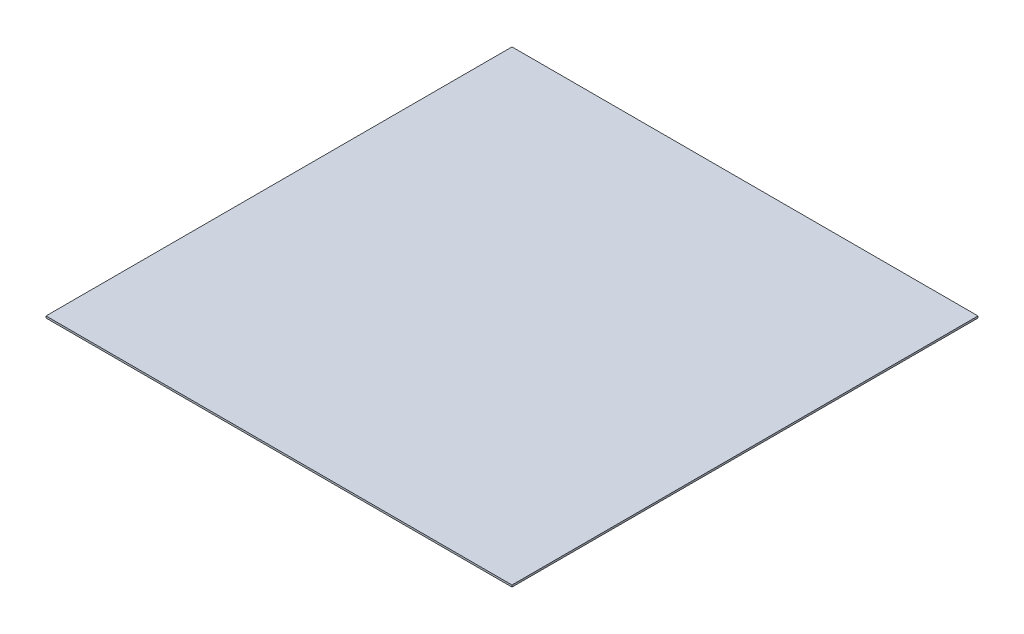
ISO-10303-21;
HEADER;
FILE_DESCRIPTION(('STEP AP214'),'2;1');
FILE_NAME('part.step','',(''),(''),'','','');
FILE_SCHEMA(('AUTOMOTIVE_DESIGN { 1 0 10303 214 1 1 1 1 }'));
ENDSEC;
DATA;
#1=APPLICATION_CONTEXT('core data for automotive mechanical design processes');
#2=APPLICATION_PROTOCOL_DEFINITION('international standard','automotive_design',2000,#1);
#3=PRODUCT_CONTEXT('',#1,'mechanical');
#4=PRODUCT('Part','Part','',(#3));
#5=PRODUCT_RELATED_PRODUCT_CATEGORY('part','',(#4));
#6=PRODUCT_DEFINITION_FORMATION('','',#4);
#7=PRODUCT_DEFINITION_CONTEXT('part definition',#1,'design');
#8=PRODUCT_DEFINITION('design','',#6,#7);
#9=PRODUCT_DEFINITION_SHAPE('','',#8);
#10=(LENGTH_UNIT() NAMED_UNIT(*) SI_UNIT(.MILLI.,.METRE.));
#11=(NAMED_UNIT(*) PLANE_ANGLE_UNIT() SI_UNIT($,.RADIAN.));
#12=(NAMED_UNIT(*) SI_UNIT($,.STERADIAN.) SOLID_ANGLE_UNIT());
#13=UNCERTAINTY_MEASURE_WITH_UNIT(LENGTH_MEASURE(1.E-05),#10,'distance_accuracy_value','');
#14=(GEOMETRIC_REPRESENTATION_CONTEXT(3) GLOBAL_UNCERTAINTY_ASSIGNED_CONTEXT((#13)) GLOBAL_UNIT_ASSIGNED_CONTEXT((#10,
#11,#12)) REPRESENTATION_CONTEXT('',''));
#15=CARTESIAN_POINT('',(0.,0.,0.));
#16=DIRECTION('',(0.,0.,1.));
#17=DIRECTION('',(1.,0.,0.));
#18=AXIS2_PLACEMENT_3D('',#15,#16,#17);
#19=CARTESIAN_POINT('',(103.,9.99999999999999,-10.));
#20=DIRECTION('',(0.,0.,1.));
#21=DIRECTION('',(1.,0.,0.));
#22=AXIS2_PLACEMENT_3D('',#19,#20,#21);
#23=PLANE('',#22);
#24=CARTESIAN_POINT('',(0.,55.,-10.));
#25=DIRECTION('',(0.,0.,1.));
#26=DIRECTION('',(1.,0.,0.));
#27=AXIS2_PLACEMENT_3D('',#24,#25,#26);
#28=CIRCLE('',#27,15.);
#29=CARTESIAN_POINT('',(-14.1421356237309,60.,-10.));
#30=VERTEX_POINT('',#29);
#31=CARTESIAN_POINT('',(-13.467179647447,48.3943151495556,-10.));
#32=VERTEX_POINT('',#31);
#33=EDGE_CURVE('E11',#30,#32,#28,.T.);
#34=ORIENTED_EDGE('',*,*,#33,.F.);
#35=DIRECTION('',(-1.,0.,0.));
#36=VECTOR('',#35,1.);
#37=CARTESIAN_POINT('',(103.,60.,-10.));
#38=LINE('',#37,#36);
#39=CARTESIAN_POINT('',(-20.,60.,-10.));
#40=VERTEX_POINT('',#39);
#41=EDGE_CURVE('E285',#30,#40,#38,.T.);
#42=ORIENTED_EDGE('',*,*,#41,.T.);
#43=DIRECTION('',(-0.330350424728106,-0.943858356366018,0.));
#44=VECTOR('',#43,1.);
#45=CARTESIAN_POINT('',(-20.,60.,-10.));
#46=LINE('',#45,#44);
#47=CARTESIAN_POINT('',(-37.5,9.99999999999999,-10.));
#48=VERTEX_POINT('',#47);
#49=EDGE_CURVE('E319',#40,#48,#46,.T.);
#50=ORIENTED_EDGE('',*,*,#49,.T.);
#51=DIRECTION('',(-1.,0.,0.));
#52=VECTOR('',#51,1.);
#53=CARTESIAN_POINT('',(103.,9.99999999999999,-10.));
#54=LINE('',#53,#52);
#55=CARTESIAN_POINT('',(-26.9051899497914,9.99999999999999,-10.));
#56=VERTEX_POINT('',#55);
#57=EDGE_CURVE('E288',#56,#48,#54,.T.);
#58=ORIENTED_EDGE('',*,*,#57,.F.);
#59=DIRECTION('',(0.330350424728106,0.943858356366017,0.));
#60=VECTOR('',#59,1.);
#61=CARTESIAN_POINT('',(-12.9051899497914,50.,-10.));
#62=LINE('',#61,#60);
#63=EDGE_CURVE('E308',#56,#32,#62,.T.);
#64=ORIENTED_EDGE('',*,*,#63,.T.);
#65=EDGE_LOOP('',(#34,#42,#50,#58,#64));
#66=FACE_BOUND('',#65,.T.);
#67=ADVANCED_FACE('F38',(#66),#23,.T.);
#68=CARTESIAN_POINT('',(103.,9.99999999999999,10.));
#69=DIRECTION('',(0.,0.,-1.));
#70=DIRECTION('',(-1.,0.,0.));
#71=AXIS2_PLACEMENT_3D('',#68,#69,#70);
#72=PLANE('',#71);
#73=CARTESIAN_POINT('',(0.,55.,10.));
#74=DIRECTION('',(0.,0.,-1.));
#75=DIRECTION('',(-1.,0.,0.));
#76=AXIS2_PLACEMENT_3D('',#73,#74,#75);
#77=CIRCLE('',#76,15.);
#78=CARTESIAN_POINT('',(14.1421356237309,60.,10.));
#79=VERTEX_POINT('',#78);
#80=CARTESIAN_POINT('',(13.467179647447,48.3943151495556,10.));
#81=VERTEX_POINT('',#80);
#82=EDGE_CURVE('E226',#79,#81,#77,.T.);
#83=ORIENTED_EDGE('',*,*,#82,.F.);
#84=DIRECTION('',(-1.,0.,0.));
#85=VECTOR('',#84,1.);
#86=CARTESIAN_POINT('',(103.,60.,10.));
#87=LINE('',#86,#85);
#88=CARTESIAN_POINT('',(20.,60.,9.99999999999999));
#89=VERTEX_POINT('',#88);
#90=EDGE_CURVE('E204',#89,#79,#87,.T.);
#91=ORIENTED_EDGE('',*,*,#90,.F.);
#92=DIRECTION('',(0.330350424728106,-0.943858356366018,0.));
#93=VECTOR('',#92,1.);
#94=CARTESIAN_POINT('',(20.,60.,9.99999999999999));
#95=LINE('',#94,#93);
#96=CARTESIAN_POINT('',(37.5,9.99999999999999,10.));
#97=VERTEX_POINT('',#96);
#98=EDGE_CURVE('E304',#89,#97,#95,.T.);
#99=ORIENTED_EDGE('',*,*,#98,.T.);
#100=DIRECTION('',(-1.,0.,0.));
#101=VECTOR('',#100,1.);
#102=CARTESIAN_POINT('',(103.,9.99999999999999,10.));
#103=LINE('',#102,#101);
#104=CARTESIAN_POINT('',(26.9051899497914,9.99999999999999,10.));
#105=VERTEX_POINT('',#104);
#106=EDGE_CURVE('E217',#97,#105,#103,.T.);
#107=ORIENTED_EDGE('',*,*,#106,.T.);
#108=DIRECTION('',(-0.330350424728106,0.943858356366018,0.));
#109=VECTOR('',#108,1.);
#110=CARTESIAN_POINT('',(12.9051899497914,50.,9.99999999999999));
#111=LINE('',#110,#109);
#112=EDGE_CURVE('E301',#105,#81,#111,.T.);
#113=ORIENTED_EDGE('',*,*,#112,.T.);
#114=EDGE_LOOP('',(#83,#91,#99,#107,#113));
#115=FACE_BOUND('',#114,.T.);
#116=ADVANCED_FACE('F470',(#115),#72,.T.);
#117=CARTESIAN_POINT('',(0.,60.,0.));
#118=DIRECTION('',(0.,1.,0.));
#119=DIRECTION('',(0.,0.,1.));
#120=AXIS2_PLACEMENT_3D('',#117,#118,#119);
#121=PLANE('',#120);
#122=DIRECTION('',(0.,0.,-1.));
#123=VECTOR('',#122,1.);
#124=CARTESIAN_POINT('',(-20.,60.,0.));
#125=LINE('',#124,#123);
#126=CARTESIAN_POINT('',(-20.,60.,-20.));
#127=VERTEX_POINT('',#126);
#128=EDGE_CURVE('E397',#40,#127,#125,.T.);
#129=ORIENTED_EDGE('',*,*,#128,.F.);
#130=ORIENTED_EDGE('',*,*,#41,.F.);
#131=CARTESIAN_POINT('',(14.1421356237309,60.,-10.));
#132=VERTEX_POINT('',#131);
#133=EDGE_CURVE('E289',#132,#30,#38,.T.);
#134=ORIENTED_EDGE('',*,*,#133,.F.);
#135=CARTESIAN_POINT('',(20.,60.,-10.));
#136=VERTEX_POINT('',#135);
#137=EDGE_CURVE('E286',#136,#132,#38,.T.);
#138=ORIENTED_EDGE('',*,*,#137,.F.);
#139=DIRECTION('',(0.,0.,1.));
#140=VECTOR('',#139,1.);
#141=CARTESIAN_POINT('',(20.,60.,0.));
#142=LINE('',#141,#140);
#143=CARTESIAN_POINT('',(20.,60.,-20.));
#144=VERTEX_POINT('',#143);
#145=EDGE_CURVE('E401',#144,#136,#142,.T.);
#146=ORIENTED_EDGE('',*,*,#145,.F.);
#147=DIRECTION('',(-1.,0.,0.));
#148=VECTOR('',#147,1.);
#149=CARTESIAN_POINT('',(103.,60.,-20.));
#150=LINE('',#149,#148);
#151=EDGE_CURVE('E321',#144,#127,#150,.T.);
#152=ORIENTED_EDGE('',*,*,#151,.T.);
#153=EDGE_LOOP('',(#129,#130,#134,#138,#146,#152));
#154=FACE_BOUND('',#153,.T.);
#155=ADVANCED_FACE('F476',(#154),#121,.T.);
#156=CARTESIAN_POINT('',(20.,60.,20.));
#157=VERTEX_POINT('',#156);
#158=EDGE_CURVE('E400',#89,#157,#142,.T.);
#159=ORIENTED_EDGE('',*,*,#158,.F.);
#160=ORIENTED_EDGE('',*,*,#90,.T.);
#161=CARTESIAN_POINT('',(-14.1421356237309,60.,10.));
#162=VERTEX_POINT('',#161);
#163=EDGE_CURVE('E197',#79,#162,#87,.T.);
#164=ORIENTED_EDGE('',*,*,#163,.T.);
#165=CARTESIAN_POINT('',(-20.,60.,10.));
#166=VERTEX_POINT('',#165);
#167=EDGE_CURVE('E202',#162,#166,#87,.T.);
#168=ORIENTED_EDGE('',*,*,#167,.T.);
#169=CARTESIAN_POINT('',(-20.,60.,20.));
#170=VERTEX_POINT('',#169);
#171=EDGE_CURVE('E398',#170,#166,#125,.T.);
#172=ORIENTED_EDGE('',*,*,#171,.F.);
#173=DIRECTION('',(-1.,0.,0.));
#174=VECTOR('',#173,1.);
#175=CARTESIAN_POINT('',(103.,60.,20.));
#176=LINE('',#175,#174);
#177=EDGE_CURVE('E324',#157,#170,#176,.T.);
#178=ORIENTED_EDGE('',*,*,#177,.F.);
#179=EDGE_LOOP('',(#159,#160,#164,#168,#172,#178));
#180=FACE_BOUND('',#179,.T.);
#181=ADVANCED_FACE('F200',(#180),#121,.T.);
#182=CARTESIAN_POINT('',(-20.,60.,-65.5));
#183=DIRECTION('',(0.943858356366017,-0.330350424728106,0.));
#184=DIRECTION('',(0.330350424728106,0.943858356366018,0.));
#185=AXIS2_PLACEMENT_3D('',#182,#183,#184);
#186=PLANE('',#185);
#187=ORIENTED_EDGE('',*,*,#49,.F.);
#188=ORIENTED_EDGE('',*,*,#128,.T.);
#189=DIRECTION('',(0.313677500463755,0.896221429896442,0.313677500463755));
#190=VECTOR('',#189,1.);
#191=CARTESIAN_POINT('',(-24.4769076305221,47.2088353413655,-24.4769076305221));
#192=LINE('',#191,#190);
#193=CARTESIAN_POINT('',(-37.5,10.,-37.5));
#194=VERTEX_POINT('',#193);
#195=EDGE_CURVE('E333',#194,#127,#192,.T.);
#196=ORIENTED_EDGE('',*,*,#195,.F.);
#197=DIRECTION('',(0.,0.,1.));
#198=VECTOR('',#197,1.);
#199=CARTESIAN_POINT('',(-37.5,10.,37.5));
#200=LINE('',#199,#198);
#201=EDGE_CURVE('E365',#194,#48,#200,.T.);
#202=ORIENTED_EDGE('',*,*,#201,.T.);
#203=EDGE_LOOP('',(#187,#188,#196,#202));
#204=FACE_BOUND('',#203,.T.);
#205=ADVANCED_FACE('F514',(#204),#186,.F.);
#206=DIRECTION('',(0.330350424728106,0.943858356366018,0.));
#207=VECTOR('',#206,1.);
#208=CARTESIAN_POINT('',(-20.,60.,9.99999999999999));
#209=LINE('',#208,#207);
#210=CARTESIAN_POINT('',(-37.5,9.99999999999999,10.));
#211=VERTEX_POINT('',#210);
#212=EDGE_CURVE('E215',#211,#166,#209,.T.);
#213=ORIENTED_EDGE('',*,*,#212,.F.);
#214=CARTESIAN_POINT('',(-37.5,9.99999999999999,37.5));
#215=VERTEX_POINT('',#214);
#216=EDGE_CURVE('E352',#211,#215,#200,.T.);
#217=ORIENTED_EDGE('',*,*,#216,.T.);
#218=DIRECTION('',(-0.313677500463755,-0.896221429896442,0.313677500463755));
#219=VECTOR('',#218,1.);
#220=CARTESIAN_POINT('',(-11.5873493975904,84.0361445783133,11.5873493975904));
#221=LINE('',#220,#219);
#222=EDGE_CURVE('E345',#170,#215,#221,.T.);
#223=ORIENTED_EDGE('',*,*,#222,.F.);
#224=ORIENTED_EDGE('',*,*,#171,.T.);
#225=EDGE_LOOP('',(#213,#217,#223,#224));
#226=FACE_BOUND('',#225,.T.);
#227=ADVANCED_FACE('F512',(#226),#186,.F.);
#228=CARTESIAN_POINT('',(20.,60.,-65.5));
#229=DIRECTION('',(-0.943858356366017,-0.330350424728106,0.));
#230=DIRECTION('',(0.330350424728106,-0.943858356366018,0.));
#231=AXIS2_PLACEMENT_3D('',#228,#229,#230);
#232=PLANE('',#231);
#233=DIRECTION('',(-0.330350424728106,0.943858356366018,0.));
#234=VECTOR('',#233,1.);
#235=CARTESIAN_POINT('',(20.,60.,-10.));
#236=LINE('',#235,#234);
#237=CARTESIAN_POINT('',(37.5,9.99999999999999,-10.));
#238=VERTEX_POINT('',#237);
#239=EDGE_CURVE('E317',#238,#136,#236,.T.);
#240=ORIENTED_EDGE('',*,*,#239,.F.);
#241=DIRECTION('',(0.,0.,-1.));
#242=VECTOR('',#241,1.);
#243=CARTESIAN_POINT('',(37.5,10.,37.5));
#244=LINE('',#243,#242);
#245=CARTESIAN_POINT('',(37.5,10.,-37.5));
#246=VERTEX_POINT('',#245);
#247=EDGE_CURVE('E372',#238,#246,#244,.T.);
#248=ORIENTED_EDGE('',*,*,#247,.T.);
#249=DIRECTION('',(0.313677500463755,-0.896221429896442,-0.313677500463755));
#250=VECTOR('',#249,1.);
#251=CARTESIAN_POINT('',(24.4769076305221,47.2088353413655,-24.4769076305221));
#252=LINE('',#251,#250);
#253=EDGE_CURVE('E330',#144,#246,#252,.T.);
#254=ORIENTED_EDGE('',*,*,#253,.F.);
#255=ORIENTED_EDGE('',*,*,#145,.T.);
#256=EDGE_LOOP('',(#240,#248,#254,#255));
#257=FACE_BOUND('',#256,.T.);
#258=ADVANCED_FACE('F509',(#257),#232,.F.);
#259=ORIENTED_EDGE('',*,*,#98,.F.);
#260=ORIENTED_EDGE('',*,*,#158,.T.);
#261=DIRECTION('',(-0.313677500463755,0.896221429896442,-0.313677500463755));
#262=VECTOR('',#261,1.);
#263=CARTESIAN_POINT('',(11.5873493975904,84.0361445783133,11.5873493975904));
#264=LINE('',#263,#262);
#265=CARTESIAN_POINT('',(37.5,9.99999999999998,37.5));
#266=VERTEX_POINT('',#265);
#267=EDGE_CURVE('E342',#266,#157,#264,.T.);
#268=ORIENTED_EDGE('',*,*,#267,.F.);
#269=EDGE_CURVE('E373',#266,#97,#244,.T.);
#270=ORIENTED_EDGE('',*,*,#269,.T.);
#271=EDGE_LOOP('',(#259,#260,#268,#270));
#272=FACE_BOUND('',#271,.T.);
#273=ADVANCED_FACE('F507',(#272),#232,.F.);
#274=CARTESIAN_POINT('',(12.9051899497914,50.,-65.5));
#275=DIRECTION('',(0.,1.,0.));
#276=DIRECTION('',(0.,0.,1.));
#277=AXIS2_PLACEMENT_3D('',#274,#275,#276);
#278=PLANE('',#277);
#279=DIRECTION('',(1.,0.,0.));
#280=VECTOR('',#279,1.);
#281=CARTESIAN_POINT('',(12.9051899497914,50.,-10.));
#282=LINE('',#281,#280);
#283=CARTESIAN_POINT('',(-12.9051899497914,50.,-10.));
#284=VERTEX_POINT('',#283);
#285=CARTESIAN_POINT('',(12.9051899497914,50.,-10.));
#286=VERTEX_POINT('',#285);
#287=EDGE_CURVE('E310',#284,#286,#282,.T.);
#288=ORIENTED_EDGE('',*,*,#287,.F.);
#289=DIRECTION('',(0.,0.,1.));
#290=VECTOR('',#289,1.);
#291=CARTESIAN_POINT('',(-12.9051899497914,50.,-65.5));
#292=LINE('',#291,#290);
#293=CARTESIAN_POINT('',(-12.9051899497914,50.,-23.5));
#294=VERTEX_POINT('',#293);
#295=EDGE_CURVE('E362',#294,#284,#292,.T.);
#296=ORIENTED_EDGE('',*,*,#295,.F.);
#297=DIRECTION('',(-1.,0.,0.));
#298=VECTOR('',#297,1.);
#299=CARTESIAN_POINT('',(12.9051899497914,50.,-23.5));
#300=LINE('',#299,#298);
#301=CARTESIAN_POINT('',(12.9051899497914,50.,-23.5));
#302=VERTEX_POINT('',#301);
#303=EDGE_CURVE('E326',#302,#294,#300,.T.);
#304=ORIENTED_EDGE('',*,*,#303,.F.);
#305=DIRECTION('',(0.,0.,1.));
#306=VECTOR('',#305,1.);
#307=CARTESIAN_POINT('',(12.9051899497914,50.,-65.5));
#308=LINE('',#307,#306);
#309=EDGE_CURVE('E349',#302,#286,#308,.T.);
#310=ORIENTED_EDGE('',*,*,#309,.T.);
#311=EDGE_LOOP('',(#288,#296,#304,#310));
#312=FACE_BOUND('',#311,.T.);
#313=ADVANCED_FACE('F504',(#312),#278,.F.);
#314=DIRECTION('',(-1.,0.,0.));
#315=VECTOR('',#314,1.);
#316=CARTESIAN_POINT('',(12.9051899497914,50.,9.99999999999999));
#317=LINE('',#316,#315);
#318=CARTESIAN_POINT('',(12.9051899497914,50.,9.99999999999999));
#319=VERTEX_POINT('',#318);
#320=CARTESIAN_POINT('',(-12.9051899497914,50.,9.99999999999999));
#321=VERTEX_POINT('',#320);
#322=EDGE_CURVE('E296',#319,#321,#317,.T.);
#323=ORIENTED_EDGE('',*,*,#322,.F.);
#324=CARTESIAN_POINT('',(12.9051899497914,50.,23.5));
#325=VERTEX_POINT('',#324);
#326=EDGE_CURVE('E353',#319,#325,#308,.T.);
#327=ORIENTED_EDGE('',*,*,#326,.T.);
#328=DIRECTION('',(1.,0.,0.));
#329=VECTOR('',#328,1.);
#330=CARTESIAN_POINT('',(12.9051899497914,50.,23.5));
#331=LINE('',#330,#329);
#332=CARTESIAN_POINT('',(-12.9051899497914,50.,23.5));
#333=VERTEX_POINT('',#332);
#334=EDGE_CURVE('E336',#333,#325,#331,.T.);
#335=ORIENTED_EDGE('',*,*,#334,.F.);
#336=EDGE_CURVE('E348',#321,#333,#292,.T.);
#337=ORIENTED_EDGE('',*,*,#336,.F.);
#338=EDGE_LOOP('',(#323,#327,#335,#337));
#339=FACE_BOUND('',#338,.T.);
#340=ADVANCED_FACE('F498',(#339),#278,.F.);
#341=CARTESIAN_POINT('',(12.9051899497914,50.,-65.5));
#342=DIRECTION('',(0.943858356366017,0.330350424728106,0.));
#343=DIRECTION('',(-0.330350424728106,0.943858356366018,0.));
#344=AXIS2_PLACEMENT_3D('',#341,#342,#343);
#345=PLANE('',#344);
#346=DIRECTION('',(0.330350424728106,-0.943858356366018,0.));
#347=VECTOR('',#346,1.);
#348=CARTESIAN_POINT('',(12.9051899497914,50.,-10.));
#349=LINE('',#348,#347);
#350=CARTESIAN_POINT('',(13.467179647447,48.3943151495556,-10.));
#351=VERTEX_POINT('',#350);
#352=EDGE_CURVE('E314',#286,#351,#349,.T.);
#353=ORIENTED_EDGE('',*,*,#352,.F.);
#354=ORIENTED_EDGE('',*,*,#309,.F.);
#355=DIRECTION('',(-0.313677500463755,0.896221429896442,0.313677500463755));
#356=VECTOR('',#355,1.);
#357=CARTESIAN_POINT('',(17.0377200702734,38.1927710843373,-27.6325301204819));
#358=LINE('',#357,#356);
#359=CARTESIAN_POINT('',(26.9051899497914,10.,-37.5));
#360=VERTEX_POINT('',#359);
#361=EDGE_CURVE('E328',#360,#302,#358,.T.);
#362=ORIENTED_EDGE('',*,*,#361,.F.);
#363=DIRECTION('',(0.,0.,1.));
#364=VECTOR('',#363,1.);
#365=CARTESIAN_POINT('',(26.9051899497914,10.,-65.5));
#366=LINE('',#365,#364);
#367=CARTESIAN_POINT('',(26.9051899497914,9.99999999999999,-10.));
#368=VERTEX_POINT('',#367);
#369=EDGE_CURVE('E354',#360,#368,#366,.T.);
#370=ORIENTED_EDGE('',*,*,#369,.T.);
#371=EDGE_CURVE('E313',#351,#368,#349,.T.);
#372=ORIENTED_EDGE('',*,*,#371,.F.);
#373=EDGE_LOOP('',(#353,#354,#362,#370,#372));
#374=FACE_BOUND('',#373,.T.);
#375=ADVANCED_FACE('F494',(#374),#345,.F.);
#376=ORIENTED_EDGE('',*,*,#112,.F.);
#377=CARTESIAN_POINT('',(26.9051899497915,9.99999999999998,37.5));
#378=VERTEX_POINT('',#377);
#379=EDGE_CURVE('E357',#105,#378,#366,.T.);
#380=ORIENTED_EDGE('',*,*,#379,.T.);
#381=DIRECTION('',(0.313677500463755,-0.896221429896442,0.313677500463755));
#382=VECTOR('',#381,1.);
#383=CARTESIAN_POINT('',(4.14816183734165,75.0200803212851,14.7429718875502));
#384=LINE('',#383,#382);
#385=EDGE_CURVE('E339',#325,#378,#384,.T.);
#386=ORIENTED_EDGE('',*,*,#385,.F.);
#387=ORIENTED_EDGE('',*,*,#326,.F.);
#388=EDGE_CURVE('E300',#81,#319,#111,.T.);
#389=ORIENTED_EDGE('',*,*,#388,.F.);
#390=EDGE_LOOP('',(#376,#380,#386,#387,#389));
#391=FACE_BOUND('',#390,.T.);
#392=ADVANCED_FACE('F497',(#391),#345,.F.);
#393=CARTESIAN_POINT('',(-12.9051899497914,50.,-65.5));
#394=DIRECTION('',(-0.943858356366017,0.330350424728106,0.));
#395=DIRECTION('',(-0.330350424728106,-0.943858356366017,0.));
#396=AXIS2_PLACEMENT_3D('',#393,#394,#395);
#397=PLANE('',#396);
#398=ORIENTED_EDGE('',*,*,#63,.F.);
#399=DIRECTION('',(0.,0.,1.));
#400=VECTOR('',#399,1.);
#401=CARTESIAN_POINT('',(-26.9051899497914,10.,-65.5));
#402=LINE('',#401,#400);
#403=CARTESIAN_POINT('',(-26.9051899497914,10.,-37.5));
#404=VERTEX_POINT('',#403);
#405=EDGE_CURVE('E358',#404,#56,#402,.T.);
#406=ORIENTED_EDGE('',*,*,#405,.F.);
#407=DIRECTION('',(-0.313677500463755,-0.896221429896442,-0.313677500463755));
#408=VECTOR('',#407,1.);
#409=CARTESIAN_POINT('',(-17.0377200702734,38.1927710843373,-27.6325301204819));
#410=LINE('',#409,#408);
#411=EDGE_CURVE('E404',#294,#404,#410,.T.);
#412=ORIENTED_EDGE('',*,*,#411,.F.);
#413=ORIENTED_EDGE('',*,*,#295,.T.);
#414=EDGE_CURVE('E307',#32,#284,#62,.T.);
#415=ORIENTED_EDGE('',*,*,#414,.F.);
#416=EDGE_LOOP('',(#398,#406,#412,#413,#415));
#417=FACE_BOUND('',#416,.T.);
#418=ADVANCED_FACE('F500',(#417),#397,.F.);
#419=DIRECTION('',(-0.330350424728106,-0.943858356366017,0.));
#420=VECTOR('',#419,1.);
#421=CARTESIAN_POINT('',(-12.9051899497914,50.,9.99999999999999));
#422=LINE('',#421,#420);
#423=CARTESIAN_POINT('',(-13.467179647447,48.3943151495556,10.));
#424=VERTEX_POINT('',#423);
#425=EDGE_CURVE('E293',#321,#424,#422,.T.);
#426=ORIENTED_EDGE('',*,*,#425,.F.);
#427=ORIENTED_EDGE('',*,*,#336,.T.);
#428=DIRECTION('',(0.313677500463755,0.896221429896442,-0.313677500463755));
#429=VECTOR('',#428,1.);
#430=CARTESIAN_POINT('',(-4.14816183734164,75.0200803212851,14.7429718875502));
#431=LINE('',#430,#429);
#432=CARTESIAN_POINT('',(-26.9051899497914,10.,37.5));
#433=VERTEX_POINT('',#432);
#434=EDGE_CURVE('E406',#433,#333,#431,.T.);
#435=ORIENTED_EDGE('',*,*,#434,.F.);
#436=CARTESIAN_POINT('',(-26.9051899497914,9.99999999999999,10.));
#437=VERTEX_POINT('',#436);
#438=EDGE_CURVE('E361',#437,#433,#402,.T.);
#439=ORIENTED_EDGE('',*,*,#438,.F.);
#440=EDGE_CURVE('E297',#424,#437,#422,.T.);
#441=ORIENTED_EDGE('',*,*,#440,.F.);
#442=EDGE_LOOP('',(#426,#427,#435,#439,#441));
#443=FACE_BOUND('',#442,.T.);
#444=ADVANCED_FACE('F451',(#443),#397,.F.);
#445=CARTESIAN_POINT('',(0.,10.,0.));
#446=DIRECTION('',(0.,-1.,0.));
#447=DIRECTION('',(0.,0.,-1.));
#448=AXIS2_PLACEMENT_3D('',#445,#446,#447);
#449=CYLINDRICAL_SURFACE('',#448,75.);
#450=CARTESIAN_POINT('',(0.,10.,0.));
#451=DIRECTION('',(0.,1.,0.));
#452=DIRECTION('',(0.,0.,1.));
#453=AXIS2_PLACEMENT_3D('',#450,#451,#452);
#454=CIRCLE('',#453,75.);
#455=CARTESIAN_POINT('',(0.,10.,75.));
#456=VERTEX_POINT('',#455);
#457=EDGE_CURVE('E389',#456,#456,#454,.T.);
#458=ORIENTED_EDGE('',*,*,#457,.F.);
#459=EDGE_LOOP('',(#458));
#460=FACE_BOUND('',#459,.T.);
#461=CARTESIAN_POINT('',(0.,0.,0.));
#462=DIRECTION('',(0.,1.,0.));
#463=DIRECTION('',(0.,0.,1.));
#464=AXIS2_PLACEMENT_3D('',#461,#462,#463);
#465=CIRCLE('',#464,75.);
#466=CARTESIAN_POINT('',(0.,0.,75.));
#467=VERTEX_POINT('',#466);
#468=EDGE_CURVE('E388',#467,#467,#465,.T.);
#469=ORIENTED_EDGE('',*,*,#468,.T.);
#470=EDGE_LOOP('',(#469));
#471=FACE_BOUND('',#470,.T.);
#472=ADVANCED_FACE('F40',(#460,#471),#449,.T.);
#473=CARTESIAN_POINT('',(0.,10.,0.));
#474=DIRECTION('',(0.,1.,0.));
#475=DIRECTION('',(0.,0.,1.));
#476=AXIS2_PLACEMENT_3D('',#473,#474,#475);
#477=PLANE('',#476);
#478=CARTESIAN_POINT('',(29.9999999999995,10.,51.9615242270666));
#479=DIRECTION('',(0.,1.,0.));
#480=DIRECTION('',(0.,0.,1.));
#481=AXIS2_PLACEMENT_3D('',#478,#479,#480);
#482=CIRCLE('',#481,5.);
#483=CARTESIAN_POINT('',(29.9999999999995,10.,56.9615242270666));
#484=VERTEX_POINT('',#483);
#485=EDGE_CURVE('E227',#484,#484,#482,.T.);
#486=ORIENTED_EDGE('',*,*,#485,.F.);
#487=EDGE_LOOP('',(#486));
#488=FACE_BOUND('',#487,.T.);
#489=CARTESIAN_POINT('',(30.0000000000002,10.,-51.9615242270662));
#490=DIRECTION('',(0.,1.,0.));
#491=DIRECTION('',(0.,0.,1.));
#492=AXIS2_PLACEMENT_3D('',#489,#490,#491);
#493=CIRCLE('',#492,5.);
#494=CARTESIAN_POINT('',(30.0000000000002,10.,-46.9615242270662));
#495=VERTEX_POINT('',#494);
#496=EDGE_CURVE('E414',#495,#495,#493,.T.);
#497=ORIENTED_EDGE('',*,*,#496,.F.);
#498=EDGE_LOOP('',(#497));
#499=FACE_BOUND('',#498,.T.);
#500=CARTESIAN_POINT('',(-60.,10.,0.));
#501=DIRECTION('',(0.,1.,0.));
#502=DIRECTION('',(0.,0.,1.));
#503=AXIS2_PLACEMENT_3D('',#500,#501,#502);
#504=CIRCLE('',#503,5.);
#505=CARTESIAN_POINT('',(-60.,10.,5.));
#506=VERTEX_POINT('',#505);
#507=EDGE_CURVE('E409',#506,#506,#504,.T.);
#508=ORIENTED_EDGE('',*,*,#507,.F.);
#509=EDGE_LOOP('',(#508));
#510=FACE_BOUND('',#509,.T.);
#511=CARTESIAN_POINT('',(0.,10.,0.));
#512=DIRECTION('',(0.,1.,0.));
#513=DIRECTION('',(0.,0.,1.));
#514=AXIS2_PLACEMENT_3D('',#511,#512,#513);
#515=CIRCLE('',#514,5.);
#516=CARTESIAN_POINT('',(0.,10.,5.));
#517=VERTEX_POINT('',#516);
#518=EDGE_CURVE('E279',#517,#517,#515,.T.);
#519=ORIENTED_EDGE('',*,*,#518,.F.);
#520=EDGE_LOOP('',(#519));
#521=FACE_BOUND('',#520,.T.);
#522=ORIENTED_EDGE('',*,*,#216,.F.);
#523=EDGE_CURVE('E283',#437,#211,#103,.T.);
#524=ORIENTED_EDGE('',*,*,#523,.F.);
#525=ORIENTED_EDGE('',*,*,#438,.T.);
#526=DIRECTION('',(1.,0.,0.));
#527=VECTOR('',#526,1.);
#528=CARTESIAN_POINT('',(37.5,10.,37.5));
#529=LINE('',#528,#527);
#530=EDGE_CURVE('E369',#215,#433,#529,.T.);
#531=ORIENTED_EDGE('',*,*,#530,.F.);
#532=EDGE_LOOP('',(#522,#524,#525,#531));
#533=FACE_BOUND('',#532,.T.);
#534=ORIENTED_EDGE('',*,*,#247,.F.);
#535=EDGE_CURVE('E292',#238,#368,#54,.T.);
#536=ORIENTED_EDGE('',*,*,#535,.T.);
#537=ORIENTED_EDGE('',*,*,#369,.F.);
#538=DIRECTION('',(-1.,0.,0.));
#539=VECTOR('',#538,1.);
#540=CARTESIAN_POINT('',(37.5,10.,-37.5));
#541=LINE('',#540,#539);
#542=EDGE_CURVE('E377',#246,#360,#541,.T.);
#543=ORIENTED_EDGE('',*,*,#542,.F.);
#544=EDGE_LOOP('',(#534,#536,#537,#543));
#545=FACE_BOUND('',#544,.T.);
#546=ORIENTED_EDGE('',*,*,#57,.T.);
#547=ORIENTED_EDGE('',*,*,#201,.F.);
#548=EDGE_CURVE('E376',#404,#194,#541,.T.);
#549=ORIENTED_EDGE('',*,*,#548,.F.);
#550=ORIENTED_EDGE('',*,*,#405,.T.);
#551=EDGE_LOOP('',(#546,#547,#549,#550));
#552=FACE_BOUND('',#551,.T.);
#553=ORIENTED_EDGE('',*,*,#379,.F.);
#554=ORIENTED_EDGE('',*,*,#106,.F.);
#555=ORIENTED_EDGE('',*,*,#269,.F.);
#556=EDGE_CURVE('E368',#378,#266,#529,.T.);
#557=ORIENTED_EDGE('',*,*,#556,.F.);
#558=EDGE_LOOP('',(#553,#554,#555,#557));
#559=FACE_BOUND('',#558,.T.);
#560=ORIENTED_EDGE('',*,*,#457,.T.);
#561=EDGE_LOOP('',(#560));
#562=FACE_BOUND('',#561,.T.);
#563=ADVANCED_FACE('F422',(#488,#499,#510,#521,#533,#545,#552,#559,#562),#477,.T.);
#564=CARTESIAN_POINT('',(0.,0.,0.));
#565=DIRECTION('',(0.,1.,0.));
#566=DIRECTION('',(0.,0.,1.));
#567=AXIS2_PLACEMENT_3D('',#564,#565,#566);
#568=PLANE('',#567);
#569=CARTESIAN_POINT('',(0.,0.,0.));
#570=DIRECTION('',(0.,1.,0.));
#571=DIRECTION('',(0.,0.,1.));
#572=AXIS2_PLACEMENT_3D('',#569,#570,#571);
#573=CIRCLE('',#572,45.);
#574=CARTESIAN_POINT('',(0.,0.,45.));
#575=VERTEX_POINT('',#574);
#576=EDGE_CURVE('E392',#575,#575,#573,.F.);
#577=ORIENTED_EDGE('',*,*,#576,.F.);
#578=EDGE_LOOP('',(#577));
#579=FACE_BOUND('',#578,.T.);
#580=ORIENTED_EDGE('',*,*,#468,.F.);
#581=EDGE_LOOP('',(#580));
#582=FACE_BOUND('',#581,.T.);
#583=ADVANCED_FACE('F425',(#579,#582),#568,.F.);
#584=CARTESIAN_POINT('',(0.,-50.,0.));
#585=DIRECTION('',(0.,-1.,0.));
#586=DIRECTION('',(0.,0.,-1.));
#587=AXIS2_PLACEMENT_3D('',#584,#585,#586);
#588=PLANE('',#587);
#589=CARTESIAN_POINT('',(0.,-50.,0.));
#590=DIRECTION('',(0.,-1.,0.));
#591=DIRECTION('',(0.,0.,-1.));
#592=AXIS2_PLACEMENT_3D('',#589,#590,#591);
#593=CIRCLE('',#592,45.);
#594=CARTESIAN_POINT('',(0.,-50.,-45.));
#595=VERTEX_POINT('',#594);
#596=EDGE_CURVE('E383',#595,#595,#593,.T.);
#597=ORIENTED_EDGE('',*,*,#596,.T.);
#598=EDGE_LOOP('',(#597));
#599=FACE_BOUND('',#598,.T.);
#600=CARTESIAN_POINT('',(0.,-50.,0.));
#601=DIRECTION('',(0.,-1.,0.));
#602=DIRECTION('',(0.,0.,-1.));
#603=AXIS2_PLACEMENT_3D('',#600,#601,#602);
#604=CIRCLE('',#603,40.);
#605=CARTESIAN_POINT('',(0.,-50.,-40.));
#606=VERTEX_POINT('',#605);
#607=EDGE_CURVE('E380',#606,#606,#604,.T.);
#608=ORIENTED_EDGE('',*,*,#607,.F.);
#609=EDGE_LOOP('',(#608));
#610=FACE_BOUND('',#609,.T.);
#611=ADVANCED_FACE('F455',(#599,#610),#588,.T.);
#612=CARTESIAN_POINT('',(0.,-50.,0.));
#613=DIRECTION('',(0.,1.,0.));
#614=DIRECTION('',(0.,0.,1.));
#615=AXIS2_PLACEMENT_3D('',#612,#613,#614);
#616=CYLINDRICAL_SURFACE('',#615,45.);
#617=ORIENTED_EDGE('',*,*,#596,.F.);
#618=EDGE_LOOP('',(#617));
#619=FACE_BOUND('',#618,.T.);
#620=ORIENTED_EDGE('',*,*,#576,.T.);
#621=EDGE_LOOP('',(#620));
#622=FACE_BOUND('',#621,.T.);
#623=ADVANCED_FACE('F461',(#619,#622),#616,.T.);
#624=CARTESIAN_POINT('',(0.,-50.,0.));
#625=DIRECTION('',(0.,1.,0.));
#626=DIRECTION('',(0.,0.,1.));
#627=AXIS2_PLACEMENT_3D('',#624,#625,#626);
#628=CYLINDRICAL_SURFACE('',#627,40.);
#629=ORIENTED_EDGE('',*,*,#607,.T.);
#630=EDGE_LOOP('',(#629));
#631=FACE_BOUND('',#630,.T.);
#632=CARTESIAN_POINT('',(0.,0.,0.));
#633=DIRECTION('',(0.,-1.,0.));
#634=DIRECTION('',(0.,0.,-1.));
#635=AXIS2_PLACEMENT_3D('',#632,#633,#634);
#636=CIRCLE('',#635,40.);
#637=CARTESIAN_POINT('',(0.,0.,-40.));
#638=VERTEX_POINT('',#637);
#639=EDGE_CURVE('E379',#638,#638,#636,.T.);
#640=ORIENTED_EDGE('',*,*,#639,.F.);
#641=EDGE_LOOP('',(#640));
#642=FACE_BOUND('',#641,.T.);
#643=ADVANCED_FACE('F467',(#631,#642),#628,.F.);
#644=CARTESIAN_POINT('',(0.,0.,0.));
#645=DIRECTION('',(0.,1.,0.));
#646=DIRECTION('',(0.,0.,1.));
#647=AXIS2_PLACEMENT_3D('',#644,#645,#646);
#648=CIRCLE('',#647,5.);
#649=CARTESIAN_POINT('',(0.,0.,5.));
#650=VERTEX_POINT('',#649);
#651=EDGE_CURVE('E282',#650,#650,#648,.T.);
#652=ORIENTED_EDGE('',*,*,#651,.T.);
#653=EDGE_LOOP('',(#652));
#654=FACE_BOUND('',#653,.T.);
#655=ORIENTED_EDGE('',*,*,#639,.T.);
#656=EDGE_LOOP('',(#655));
#657=FACE_BOUND('',#656,.T.);
#658=ADVANCED_FACE('F457',(#654,#657),#568,.F.);
#659=CARTESIAN_POINT('',(103.,60.,-20.));
#660=DIRECTION('',(0.,0.330350424728106,-0.943858356366017));
#661=DIRECTION('',(0.,0.943858356366017,0.330350424728106));
#662=AXIS2_PLACEMENT_3D('',#659,#660,#661);
#663=PLANE('',#662);
#664=ORIENTED_EDGE('',*,*,#195,.T.);
#665=ORIENTED_EDGE('',*,*,#151,.F.);
#666=ORIENTED_EDGE('',*,*,#253,.T.);
#667=ORIENTED_EDGE('',*,*,#542,.T.);
#668=ORIENTED_EDGE('',*,*,#361,.T.);
#669=ORIENTED_EDGE('',*,*,#303,.T.);
#670=ORIENTED_EDGE('',*,*,#411,.T.);
#671=ORIENTED_EDGE('',*,*,#548,.T.);
#672=EDGE_LOOP('',(#664,#665,#666,#667,#668,#669,#670,#671));
#673=FACE_BOUND('',#672,.T.);
#674=ADVANCED_FACE('F466',(#673),#663,.T.);
#675=CARTESIAN_POINT('',(103.,60.,20.));
#676=DIRECTION('',(0.,0.330350424728106,0.943858356366017));
#677=DIRECTION('',(0.,-0.943858356366018,0.330350424728106));
#678=AXIS2_PLACEMENT_3D('',#675,#676,#677);
#679=PLANE('',#678);
#680=ORIENTED_EDGE('',*,*,#222,.T.);
#681=ORIENTED_EDGE('',*,*,#530,.T.);
#682=ORIENTED_EDGE('',*,*,#434,.T.);
#683=ORIENTED_EDGE('',*,*,#334,.T.);
#684=ORIENTED_EDGE('',*,*,#385,.T.);
#685=ORIENTED_EDGE('',*,*,#556,.T.);
#686=ORIENTED_EDGE('',*,*,#267,.T.);
#687=ORIENTED_EDGE('',*,*,#177,.T.);
#688=EDGE_LOOP('',(#680,#681,#682,#683,#684,#685,#686,#687));
#689=FACE_BOUND('',#688,.T.);
#690=ADVANCED_FACE('F481',(#689),#679,.T.);
#691=EDGE_CURVE('E42',#351,#132,#28,.T.);
#692=ORIENTED_EDGE('',*,*,#691,.F.);
#693=ORIENTED_EDGE('',*,*,#371,.T.);
#694=ORIENTED_EDGE('',*,*,#535,.F.);
#695=ORIENTED_EDGE('',*,*,#239,.T.);
#696=ORIENTED_EDGE('',*,*,#137,.T.);
#697=EDGE_LOOP('',(#692,#693,#694,#695,#696));
#698=FACE_BOUND('',#697,.T.);
#699=ADVANCED_FACE('F472',(#698),#23,.T.);
#700=EDGE_CURVE('E212',#424,#162,#77,.T.);
#701=ORIENTED_EDGE('',*,*,#700,.F.);
#702=ORIENTED_EDGE('',*,*,#440,.T.);
#703=ORIENTED_EDGE('',*,*,#523,.T.);
#704=ORIENTED_EDGE('',*,*,#212,.T.);
#705=ORIENTED_EDGE('',*,*,#167,.F.);
#706=EDGE_LOOP('',(#701,#702,#703,#704,#705));
#707=FACE_BOUND('',#706,.T.);
#708=ADVANCED_FACE('F211',(#707),#72,.T.);
#709=CARTESIAN_POINT('',(0.,-93.,0.));
#710=DIRECTION('',(0.,1.,0.));
#711=DIRECTION('',(0.,0.,1.));
#712=AXIS2_PLACEMENT_3D('',#709,#710,#711);
#713=CYLINDRICAL_SURFACE('',#712,5.);
#714=ORIENTED_EDGE('',*,*,#518,.T.);
#715=EDGE_LOOP('',(#714));
#716=FACE_BOUND('',#715,.T.);
#717=ORIENTED_EDGE('',*,*,#651,.F.);
#718=EDGE_LOOP('',(#717));
#719=FACE_BOUND('',#718,.T.);
#720=ADVANCED_FACE('F486',(#716,#719),#713,.F.);
#721=CARTESIAN_POINT('',(-60.,10.,0.));
#722=DIRECTION('',(0.,1.,0.));
#723=DIRECTION('',(0.,0.,1.));
#724=AXIS2_PLACEMENT_3D('',#721,#722,#723);
#725=CYLINDRICAL_SURFACE('',#724,5.);
#726=CARTESIAN_POINT('',(-60.,210.,0.));
#727=DIRECTION('',(0.,1.,0.));
#728=DIRECTION('',(0.,0.,1.));
#729=AXIS2_PLACEMENT_3D('',#726,#727,#728);
#730=CIRCLE('',#729,5.);
#731=CARTESIAN_POINT('',(-60.,210.,5.));
#732=VERTEX_POINT('',#731);
#733=EDGE_CURVE('E276',#732,#732,#730,.T.);
#734=ORIENTED_EDGE('',*,*,#733,.F.);
#735=EDGE_LOOP('',(#734));
#736=FACE_BOUND('',#735,.T.);
#737=ORIENTED_EDGE('',*,*,#507,.T.);
#738=EDGE_LOOP('',(#737));
#739=FACE_BOUND('',#738,.T.);
#740=ADVANCED_FACE('F792',(#736,#739),#725,.T.);
#741=CARTESIAN_POINT('',(30.0000000000002,10.,-51.9615242270662));
#742=DIRECTION('',(0.,1.,0.));
#743=DIRECTION('',(0.,0.,1.));
#744=AXIS2_PLACEMENT_3D('',#741,#742,#743);
#745=CYLINDRICAL_SURFACE('',#744,5.);
#746=CARTESIAN_POINT('',(30.0000000000002,210.,-51.9615242270662));
#747=DIRECTION('',(0.,1.,0.));
#748=DIRECTION('',(0.,0.,1.));
#749=AXIS2_PLACEMENT_3D('',#746,#747,#748);
#750=CIRCLE('',#749,5.);
#751=CARTESIAN_POINT('',(30.0000000000002,210.,-46.9615242270662));
#752=VERTEX_POINT('',#751);
#753=EDGE_CURVE('E273',#752,#752,#750,.T.);
#754=ORIENTED_EDGE('',*,*,#753,.F.);
#755=EDGE_LOOP('',(#754));
#756=FACE_BOUND('',#755,.T.);
#757=ORIENTED_EDGE('',*,*,#496,.T.);
#758=EDGE_LOOP('',(#757));
#759=FACE_BOUND('',#758,.T.);
#760=ADVANCED_FACE('F784',(#756,#759),#745,.T.);
#761=CARTESIAN_POINT('',(29.9999999999995,10.,51.9615242270666));
#762=DIRECTION('',(0.,1.,0.));
#763=DIRECTION('',(0.,0.,1.));
#764=AXIS2_PLACEMENT_3D('',#761,#762,#763);
#765=CYLINDRICAL_SURFACE('',#764,5.);
#766=CARTESIAN_POINT('',(29.9999999999995,210.,51.9615242270666));
#767=DIRECTION('',(0.,1.,0.));
#768=DIRECTION('',(0.,0.,1.));
#769=AXIS2_PLACEMENT_3D('',#766,#767,#768);
#770=CIRCLE('',#769,5.);
#771=CARTESIAN_POINT('',(29.9999999999995,210.,56.9615242270666));
#772=VERTEX_POINT('',#771);
#773=EDGE_CURVE('E270',#772,#772,#770,.T.);
#774=ORIENTED_EDGE('',*,*,#773,.F.);
#775=EDGE_LOOP('',(#774));
#776=FACE_BOUND('',#775,.T.);
#777=ORIENTED_EDGE('',*,*,#485,.T.);
#778=EDGE_LOOP('',(#777));
#779=FACE_BOUND('',#778,.T.);
#780=ADVANCED_FACE('F420',(#776,#779),#765,.T.);
#781=CARTESIAN_POINT('',(500.,214.,500.));
#782=DIRECTION('',(-1.,0.,0.));
#783=DIRECTION('',(0.,0.,1.));
#784=AXIS2_PLACEMENT_3D('',#781,#782,#783);
#785=PLANE('',#784);
#786=DIRECTION('',(0.,0.,-1.));
#787=VECTOR('',#786,1.);
#788=CARTESIAN_POINT('',(500.,210.,500.));
#789=LINE('',#788,#787);
#790=CARTESIAN_POINT('',(500.,210.,500.));
#791=VERTEX_POINT('',#790);
#792=CARTESIAN_POINT('',(500.,210.,-500.));
#793=VERTEX_POINT('',#792);
#794=EDGE_CURVE('E240',#791,#793,#789,.T.);
#795=ORIENTED_EDGE('',*,*,#794,.T.);
#796=DIRECTION('',(0.,-1.,0.));
#797=VECTOR('',#796,1.);
#798=CARTESIAN_POINT('',(500.,214.,-500.));
#799=LINE('',#798,#797);
#800=CARTESIAN_POINT('',(500.,214.,-500.));
#801=VERTEX_POINT('',#800);
#802=EDGE_CURVE('E267',#801,#793,#799,.T.);
#803=ORIENTED_EDGE('',*,*,#802,.F.);
#804=DIRECTION('',(0.,0.,-1.));
#805=VECTOR('',#804,1.);
#806=CARTESIAN_POINT('',(500.,214.,500.));
#807=LINE('',#806,#805);
#808=CARTESIAN_POINT('',(500.,214.,500.));
#809=VERTEX_POINT('',#808);
#810=EDGE_CURVE('E241',#809,#801,#807,.T.);
#811=ORIENTED_EDGE('',*,*,#810,.F.);
#812=DIRECTION('',(0.,-1.,0.));
#813=VECTOR('',#812,1.);
#814=CARTESIAN_POINT('',(500.,214.,500.));
#815=LINE('',#814,#813);
#816=EDGE_CURVE('E251',#809,#791,#815,.T.);
#817=ORIENTED_EDGE('',*,*,#816,.T.);
#818=EDGE_LOOP('',(#795,#803,#811,#817));
#819=FACE_BOUND('',#818,.T.);
#820=ADVANCED_FACE('F769',(#819),#785,.F.);
#821=CARTESIAN_POINT('',(-500.,214.,-500.));
#822=DIRECTION('',(0.,0.,1.));
#823=DIRECTION('',(1.,0.,0.));
#824=AXIS2_PLACEMENT_3D('',#821,#822,#823);
#825=PLANE('',#824);
#826=DIRECTION('',(-1.,0.,0.));
#827=VECTOR('',#826,1.);
#828=CARTESIAN_POINT('',(-500.,210.,-500.));
#829=LINE('',#828,#827);
#830=CARTESIAN_POINT('',(-500.,210.,-500.));
#831=VERTEX_POINT('',#830);
#832=EDGE_CURVE('E254',#793,#831,#829,.T.);
#833=ORIENTED_EDGE('',*,*,#832,.T.);
#834=DIRECTION('',(0.,-1.,0.));
#835=VECTOR('',#834,1.);
#836=CARTESIAN_POINT('',(-500.,214.,-500.));
#837=LINE('',#836,#835);
#838=CARTESIAN_POINT('',(-500.,214.,-500.));
#839=VERTEX_POINT('',#838);
#840=EDGE_CURVE('E264',#839,#831,#837,.T.);
#841=ORIENTED_EDGE('',*,*,#840,.F.);
#842=DIRECTION('',(-1.,0.,0.));
#843=VECTOR('',#842,1.);
#844=CARTESIAN_POINT('',(-500.,214.,-500.));
#845=LINE('',#844,#843);
#846=EDGE_CURVE('E244',#801,#839,#845,.T.);
#847=ORIENTED_EDGE('',*,*,#846,.F.);
#848=ORIENTED_EDGE('',*,*,#802,.T.);
#849=EDGE_LOOP('',(#833,#841,#847,#848));
#850=FACE_BOUND('',#849,.T.);
#851=ADVANCED_FACE('F761',(#850),#825,.F.);
#852=CARTESIAN_POINT('',(-500.,214.,500.));
#853=DIRECTION('',(1.,0.,0.));
#854=DIRECTION('',(0.,0.,-1.));
#855=AXIS2_PLACEMENT_3D('',#852,#853,#854);
#856=PLANE('',#855);
#857=DIRECTION('',(0.,0.,1.));
#858=VECTOR('',#857,1.);
#859=CARTESIAN_POINT('',(-500.,210.,500.));
#860=LINE('',#859,#858);
#861=CARTESIAN_POINT('',(-500.,210.,500.));
#862=VERTEX_POINT('',#861);
#863=EDGE_CURVE('E256',#831,#862,#860,.T.);
#864=ORIENTED_EDGE('',*,*,#863,.T.);
#865=DIRECTION('',(0.,-1.,0.));
#866=VECTOR('',#865,1.);
#867=CARTESIAN_POINT('',(-500.,214.,500.));
#868=LINE('',#867,#866);
#869=CARTESIAN_POINT('',(-500.,214.,500.));
#870=VERTEX_POINT('',#869);
#871=EDGE_CURVE('E261',#870,#862,#868,.T.);
#872=ORIENTED_EDGE('',*,*,#871,.F.);
#873=DIRECTION('',(0.,0.,1.));
#874=VECTOR('',#873,1.);
#875=CARTESIAN_POINT('',(-500.,214.,500.));
#876=LINE('',#875,#874);
#877=EDGE_CURVE('E247',#839,#870,#876,.T.);
#878=ORIENTED_EDGE('',*,*,#877,.F.);
#879=ORIENTED_EDGE('',*,*,#840,.T.);
#880=EDGE_LOOP('',(#864,#872,#878,#879));
#881=FACE_BOUND('',#880,.T.);
#882=ADVANCED_FACE('F753',(#881),#856,.F.);
#883=CARTESIAN_POINT('',(-500.,214.,500.));
#884=DIRECTION('',(0.,0.,-1.));
#885=DIRECTION('',(-1.,0.,0.));
#886=AXIS2_PLACEMENT_3D('',#883,#884,#885);
#887=PLANE('',#886);
#888=DIRECTION('',(1.,0.,0.));
#889=VECTOR('',#888,1.);
#890=CARTESIAN_POINT('',(-500.,210.,500.));
#891=LINE('',#890,#889);
#892=EDGE_CURVE('E245',#862,#791,#891,.T.);
#893=ORIENTED_EDGE('',*,*,#892,.T.);
#894=ORIENTED_EDGE('',*,*,#816,.F.);
#895=DIRECTION('',(1.,0.,0.));
#896=VECTOR('',#895,1.);
#897=CARTESIAN_POINT('',(-500.,214.,500.));
#898=LINE('',#897,#896);
#899=EDGE_CURVE('E249',#870,#809,#898,.T.);
#900=ORIENTED_EDGE('',*,*,#899,.F.);
#901=ORIENTED_EDGE('',*,*,#871,.T.);
#902=EDGE_LOOP('',(#893,#894,#900,#901));
#903=FACE_BOUND('',#902,.T.);
#904=ADVANCED_FACE('F746',(#903),#887,.F.);
#905=CARTESIAN_POINT('',(0.,214.,0.));
#906=DIRECTION('',(0.,-1.,0.));
#907=DIRECTION('',(0.,0.,-1.));
#908=AXIS2_PLACEMENT_3D('',#905,#906,#907);
#909=PLANE('',#908);
#910=ORIENTED_EDGE('',*,*,#810,.T.);
#911=ORIENTED_EDGE('',*,*,#846,.T.);
#912=ORIENTED_EDGE('',*,*,#877,.T.);
#913=ORIENTED_EDGE('',*,*,#899,.T.);
#914=EDGE_LOOP('',(#910,#911,#912,#913));
#915=FACE_BOUND('',#914,.T.);
#916=ADVANCED_FACE('F739',(#915),#909,.F.);
#917=CARTESIAN_POINT('',(0.,210.,0.));
#918=DIRECTION('',(0.,-1.,0.));
#919=DIRECTION('',(0.,0.,-1.));
#920=AXIS2_PLACEMENT_3D('',#917,#918,#919);
#921=PLANE('',#920);
#922=ORIENTED_EDGE('',*,*,#733,.T.);
#923=EDGE_LOOP('',(#922));
#924=FACE_BOUND('',#923,.T.);
#925=ORIENTED_EDGE('',*,*,#753,.T.);
#926=EDGE_LOOP('',(#925));
#927=FACE_BOUND('',#926,.T.);
#928=ORIENTED_EDGE('',*,*,#773,.T.);
#929=EDGE_LOOP('',(#928));
#930=FACE_BOUND('',#929,.T.);
#931=ORIENTED_EDGE('',*,*,#794,.F.);
#932=ORIENTED_EDGE('',*,*,#892,.F.);
#933=ORIENTED_EDGE('',*,*,#863,.F.);
#934=ORIENTED_EDGE('',*,*,#832,.F.);
#935=EDGE_LOOP('',(#931,#932,#933,#934));
#936=FACE_BOUND('',#935,.T.);
#937=ADVANCED_FACE('F647',(#924,#927,#930,#936),#921,.T.);
#938=CARTESIAN_POINT('',(0.,55.,-10.));
#939=DIRECTION('',(0.,0.,-1.));
#940=DIRECTION('',(-1.,0.,0.));
#941=AXIS2_PLACEMENT_3D('',#938,#939,#940);
#942=PLANE('',#941);
#943=ORIENTED_EDGE('',*,*,#352,.T.);
#944=CARTESIAN_POINT('',(0.,55.,-10.));
#945=DIRECTION('',(0.,0.,-1.));
#946=DIRECTION('',(-1.,0.,0.));
#947=AXIS2_PLACEMENT_3D('',#944,#945,#946);
#948=CIRCLE('',#947,15.);
#949=EDGE_CURVE('E907',#351,#32,#948,.T.);
#950=ORIENTED_EDGE('',*,*,#949,.T.);
#951=ORIENTED_EDGE('',*,*,#414,.T.);
#952=ORIENTED_EDGE('',*,*,#287,.T.);
#953=EDGE_LOOP('',(#943,#950,#951,#952));
#954=FACE_BOUND('',#953,.T.);
#955=ADVANCED_FACE('F654',(#954),#942,.T.);
#956=CARTESIAN_POINT('',(0.,70.,9.99999999999999));
#957=DIRECTION('',(0.,0.,1.));
#958=DIRECTION('',(1.,0.,0.));
#959=AXIS2_PLACEMENT_3D('',#956,#957,#958);
#960=PLANE('',#959);
#961=ORIENTED_EDGE('',*,*,#388,.T.);
#962=ORIENTED_EDGE('',*,*,#322,.T.);
#963=ORIENTED_EDGE('',*,*,#425,.T.);
#964=CARTESIAN_POINT('',(0.,55.,10.));
#965=DIRECTION('',(0.,0.,-1.));
#966=DIRECTION('',(-1.,0.,0.));
#967=AXIS2_PLACEMENT_3D('',#964,#965,#966);
#968=CIRCLE('',#967,15.);
#969=EDGE_CURVE('E225',#81,#424,#968,.T.);
#970=ORIENTED_EDGE('',*,*,#969,.F.);
#971=EDGE_LOOP('',(#961,#962,#963,#970));
#972=FACE_BOUND('',#971,.T.);
#973=ADVANCED_FACE('F659',(#972),#960,.T.);
#974=CARTESIAN_POINT('',(0.,55.,-10.));
#975=DIRECTION('',(0.,0.,-1.));
#976=DIRECTION('',(-1.,0.,0.));
#977=AXIS2_PLACEMENT_3D('',#974,#975,#976);
#978=CYLINDRICAL_SURFACE('',#977,5.00446522325514);
#979=CARTESIAN_POINT('',(0.,55.,3.23751753225011));
#980=DIRECTION('',(0.,0.,-1.));
#981=DIRECTION('',(-1.,0.,0.));
#982=AXIS2_PLACEMENT_3D('',#979,#980,#981);
#983=CIRCLE('',#982,5.00446522325514);
#984=CARTESIAN_POINT('',(-5.00446522325514,55.,3.23751753225011));
#985=VERTEX_POINT('',#984);
#986=EDGE_CURVE('E232',#985,#985,#983,.T.);
#987=ORIENTED_EDGE('',*,*,#986,.T.);
#988=EDGE_LOOP('',(#987));
#989=FACE_BOUND('',#988,.T.);
#990=CARTESIAN_POINT('',(0.,55.,-3.23751753225019));
#991=DIRECTION('',(0.,0.,-1.));
#992=DIRECTION('',(-1.,0.,0.));
#993=AXIS2_PLACEMENT_3D('',#990,#991,#992);
#994=CIRCLE('',#993,5.00446522325514);
#995=CARTESIAN_POINT('',(-5.00446522325514,55.,-3.23751753225019));
#996=VERTEX_POINT('',#995);
#997=EDGE_CURVE('E913',#996,#996,#994,.T.);
#998=ORIENTED_EDGE('',*,*,#997,.F.);
#999=EDGE_LOOP('',(#998));
#1000=FACE_BOUND('',#999,.T.);
#1001=ADVANCED_FACE('F669',(#989,#1000),#978,.T.);
#1002=CARTESIAN_POINT('',(0.,55.,3.23751753225011));
#1003=DIRECTION('',(0.,0.,1.));
#1004=DIRECTION('',(1.,0.,0.));
#1005=AXIS2_PLACEMENT_3D('',#1002,#1003,#1004);
#1006=CONICAL_SURFACE('',#1005,5.00446522325514,1.39626340159546);
#1007=CARTESIAN_POINT('',(0.,55.,5.));
#1008=DIRECTION('',(0.,0.,-1.));
#1009=DIRECTION('',(-1.,0.,0.));
#1010=AXIS2_PLACEMENT_3D('',#1007,#1008,#1009);
#1011=CIRCLE('',#1010,15.);
#1012=CARTESIAN_POINT('',(-15.,55.,5.));
#1013=VERTEX_POINT('',#1012);
#1014=EDGE_CURVE('E229',#1013,#1013,#1011,.T.);
#1015=ORIENTED_EDGE('',*,*,#1014,.T.);
#1016=EDGE_LOOP('',(#1015));
#1017=FACE_BOUND('',#1016,.T.);
#1018=ORIENTED_EDGE('',*,*,#986,.F.);
#1019=EDGE_LOOP('',(#1018));
#1020=FACE_BOUND('',#1019,.T.);
#1021=ADVANCED_FACE('F678',(#1017,#1020),#1006,.T.);
#1022=CARTESIAN_POINT('',(0.,55.,-10.));
#1023=DIRECTION('',(0.,0.,-1.));
#1024=DIRECTION('',(-1.,0.,0.));
#1025=AXIS2_PLACEMENT_3D('',#1022,#1023,#1024);
#1026=CYLINDRICAL_SURFACE('',#1025,15.);
#1027=EDGE_CURVE('E223',#162,#79,#968,.T.);
#1028=ORIENTED_EDGE('',*,*,#1027,.T.);
#1029=ORIENTED_EDGE('',*,*,#82,.T.);
#1030=ORIENTED_EDGE('',*,*,#969,.T.);
#1031=ORIENTED_EDGE('',*,*,#700,.T.);
#1032=EDGE_LOOP('',(#1028,#1029,#1030,#1031));
#1033=FACE_BOUND('',#1032,.T.);
#1034=ORIENTED_EDGE('',*,*,#1014,.F.);
#1035=EDGE_LOOP('',(#1034));
#1036=FACE_BOUND('',#1035,.T.);
#1037=ADVANCED_FACE('F220',(#1033,#1036),#1026,.T.);
#1038=ORIENTED_EDGE('',*,*,#1027,.F.);
#1039=ORIENTED_EDGE('',*,*,#163,.F.);
#1040=EDGE_LOOP('',(#1038,#1039));
#1041=FACE_BOUND('',#1040,.T.);
#1042=ADVANCED_FACE('F228',(#1041),#960,.T.);
#1043=EDGE_CURVE('E234',#30,#132,#948,.T.);
#1044=ORIENTED_EDGE('',*,*,#1043,.T.);
#1045=ORIENTED_EDGE('',*,*,#133,.T.);
#1046=EDGE_LOOP('',(#1044,#1045));
#1047=FACE_BOUND('',#1046,.T.);
#1048=ADVANCED_FACE('F662',(#1047),#942,.T.);
#1049=CARTESIAN_POINT('',(0.,55.,-10.));
#1050=DIRECTION('',(0.,0.,-1.));
#1051=DIRECTION('',(-1.,0.,0.));
#1052=AXIS2_PLACEMENT_3D('',#1049,#1050,#1051);
#1053=CYLINDRICAL_SURFACE('',#1052,15.);
#1054=CARTESIAN_POINT('',(0.,55.,-5.));
#1055=DIRECTION('',(0.,0.,-1.));
#1056=DIRECTION('',(-1.,0.,0.));
#1057=AXIS2_PLACEMENT_3D('',#1054,#1055,#1056);
#1058=CIRCLE('',#1057,15.);
#1059=CARTESIAN_POINT('',(-15.,55.,-5.));
#1060=VERTEX_POINT('',#1059);
#1061=EDGE_CURVE('E910',#1060,#1060,#1058,.T.);
#1062=ORIENTED_EDGE('',*,*,#1061,.T.);
#1063=EDGE_LOOP('',(#1062));
#1064=FACE_BOUND('',#1063,.T.);
#1065=ORIENTED_EDGE('',*,*,#1043,.F.);
#1066=ORIENTED_EDGE('',*,*,#33,.T.);
#1067=ORIENTED_EDGE('',*,*,#949,.F.);
#1068=ORIENTED_EDGE('',*,*,#691,.T.);
#1069=EDGE_LOOP('',(#1065,#1066,#1067,#1068));
#1070=FACE_BOUND('',#1069,.T.);
#1071=ADVANCED_FACE('F708',(#1064,#1070),#1053,.T.);
#1072=CARTESIAN_POINT('',(0.,55.,-5.));
#1073=DIRECTION('',(0.,0.,-1.));
#1074=DIRECTION('',(-1.,0.,0.));
#1075=AXIS2_PLACEMENT_3D('',#1072,#1073,#1074);
#1076=CONICAL_SURFACE('',#1075,15.,1.39626340159547);
#1077=ORIENTED_EDGE('',*,*,#997,.T.);
#1078=EDGE_LOOP('',(#1077));
#1079=FACE_BOUND('',#1078,.T.);
#1080=ORIENTED_EDGE('',*,*,#1061,.F.);
#1081=EDGE_LOOP('',(#1080));
#1082=FACE_BOUND('',#1081,.T.);
#1083=ADVANCED_FACE('F716',(#1079,#1082),#1076,.T.);
#1084=CLOSED_SHELL('',(#67,#116,#155,#181,#205,#227,#258,#273,#313,#340,#375,#392,#418,#444,
#472,#563,#583,#611,#623,#643,#658,#674,#690,#699,#708,#720,#740,#760,#780,#820,#851,#882,#904,
#916,#937,#955,#973,#1001,#1021,#1037,#1042,#1048,#1071,#1083));
#1085=MANIFOLD_SOLID_BREP('B2',#1084);
#1086=ADVANCED_BREP_SHAPE_REPRESENTATION('',(#18,#1085),#14);
#1087=SHAPE_DEFINITION_REPRESENTATION(#9,#1086);
ENDSEC;
END-ISO-10303-21;
